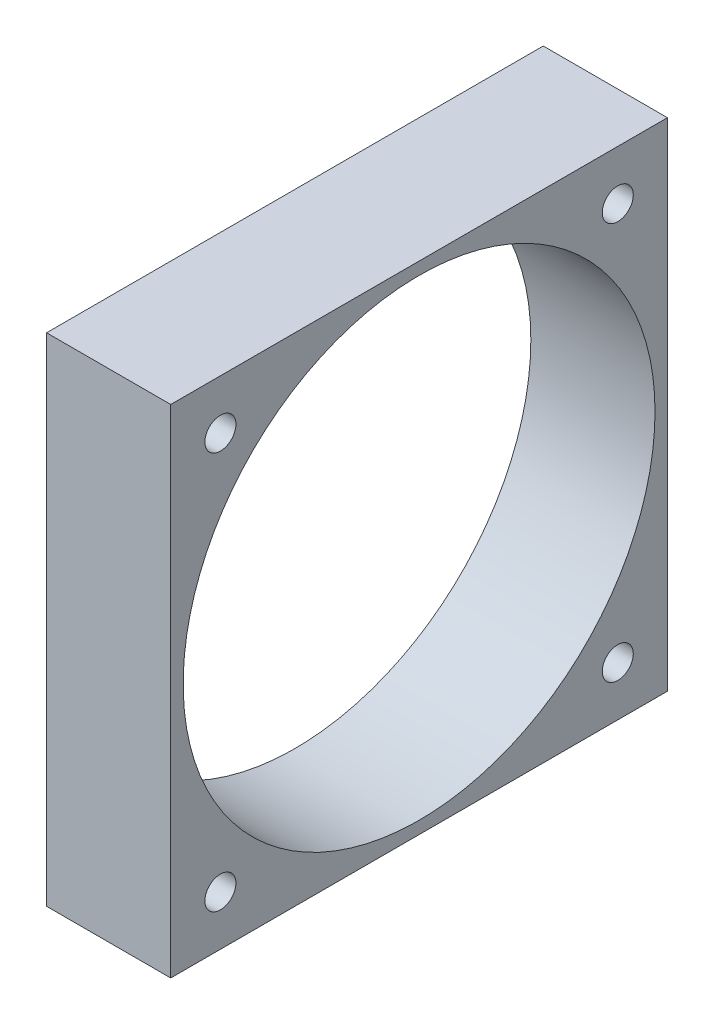
ISO-10303-21;
HEADER;
FILE_DESCRIPTION(('STEP AP214'),'2;1');
FILE_NAME('part.step','',(''),(''),'','','');
FILE_SCHEMA(('AUTOMOTIVE_DESIGN { 1 0 10303 214 1 1 1 1 }'));
ENDSEC;
DATA;
#1=APPLICATION_CONTEXT('core data for automotive mechanical design processes');
#2=APPLICATION_PROTOCOL_DEFINITION('international standard','automotive_design',2000,#1);
#3=PRODUCT_CONTEXT('',#1,'mechanical');
#4=PRODUCT('Part','Part','',(#3));
#5=PRODUCT_RELATED_PRODUCT_CATEGORY('part','',(#4));
#6=PRODUCT_DEFINITION_FORMATION('','',#4);
#7=PRODUCT_DEFINITION_CONTEXT('part definition',#1,'design');
#8=PRODUCT_DEFINITION('design','',#6,#7);
#9=PRODUCT_DEFINITION_SHAPE('','',#8);
#10=(LENGTH_UNIT() NAMED_UNIT(*) SI_UNIT(.MILLI.,.METRE.));
#11=(NAMED_UNIT(*) PLANE_ANGLE_UNIT() SI_UNIT($,.RADIAN.));
#12=(NAMED_UNIT(*) SI_UNIT($,.STERADIAN.) SOLID_ANGLE_UNIT());
#13=UNCERTAINTY_MEASURE_WITH_UNIT(LENGTH_MEASURE(1.E-05),#10,'distance_accuracy_value','');
#14=(GEOMETRIC_REPRESENTATION_CONTEXT(3) GLOBAL_UNCERTAINTY_ASSIGNED_CONTEXT((#13)) GLOBAL_UNIT_ASSIGNED_CONTEXT((#10,
#11,#12)) REPRESENTATION_CONTEXT('',''));
#15=CARTESIAN_POINT('',(0.,0.,0.));
#16=DIRECTION('',(0.,0.,1.));
#17=DIRECTION('',(1.,0.,0.));
#18=AXIS2_PLACEMENT_3D('',#15,#16,#17);
#19=CARTESIAN_POINT('',(10.,0.,0.));
#20=DIRECTION('',(1.,0.,0.));
#21=DIRECTION('',(0.,0.,-1.));
#22=AXIS2_PLACEMENT_3D('',#19,#20,#21);
#23=PLANE('',#22);
#24=CARTESIAN_POINT('',(10.,-16.0000000000001,-16.));
#25=DIRECTION('',(1.,0.,0.));
#26=DIRECTION('',(0.,0.,-1.));
#27=AXIS2_PLACEMENT_3D('',#24,#25,#26);
#28=CIRCLE('',#27,1.25);
#29=CARTESIAN_POINT('',(10.,-16.0000000000001,-17.25));
#30=VERTEX_POINT('',#29);
#31=EDGE_CURVE('E133',#30,#30,#28,.T.);
#32=ORIENTED_EDGE('',*,*,#31,.F.);
#33=EDGE_LOOP('',(#32));
#34=FACE_BOUND('',#33,.T.);
#35=CARTESIAN_POINT('',(10.,16.,16.));
#36=DIRECTION('',(1.,0.,0.));
#37=DIRECTION('',(0.,0.,-1.));
#38=AXIS2_PLACEMENT_3D('',#35,#36,#37);
#39=CIRCLE('',#38,1.25);
#40=CARTESIAN_POINT('',(10.,16.,14.75));
#41=VERTEX_POINT('',#40);
#42=EDGE_CURVE('E121',#41,#41,#39,.T.);
#43=ORIENTED_EDGE('',*,*,#42,.F.);
#44=EDGE_LOOP('',(#43));
#45=FACE_BOUND('',#44,.T.);
#46=DIRECTION('',(0.,1.,0.));
#47=VECTOR('',#46,1.);
#48=CARTESIAN_POINT('',(10.,20.,-20.));
#49=LINE('',#48,#47);
#50=CARTESIAN_POINT('',(10.,-20.,-20.));
#51=VERTEX_POINT('',#50);
#52=CARTESIAN_POINT('',(10.,20.,-20.));
#53=VERTEX_POINT('',#52);
#54=EDGE_CURVE('E91',#51,#53,#49,.T.);
#55=ORIENTED_EDGE('',*,*,#54,.T.);
#56=DIRECTION('',(0.,0.,1.));
#57=VECTOR('',#56,1.);
#58=CARTESIAN_POINT('',(10.,20.,20.));
#59=LINE('',#58,#57);
#60=CARTESIAN_POINT('',(10.,20.,20.));
#61=VERTEX_POINT('',#60);
#62=EDGE_CURVE('E86',#53,#61,#59,.T.);
#63=ORIENTED_EDGE('',*,*,#62,.T.);
#64=DIRECTION('',(0.,-1.,0.));
#65=VECTOR('',#64,1.);
#66=CARTESIAN_POINT('',(10.,20.,20.));
#67=LINE('',#66,#65);
#68=CARTESIAN_POINT('',(10.,-20.,20.));
#69=VERTEX_POINT('',#68);
#70=EDGE_CURVE('E89',#61,#69,#67,.T.);
#71=ORIENTED_EDGE('',*,*,#70,.T.);
#72=DIRECTION('',(0.,0.,-1.));
#73=VECTOR('',#72,1.);
#74=CARTESIAN_POINT('',(10.,-20.,20.));
#75=LINE('',#74,#73);
#76=EDGE_CURVE('E56',#69,#51,#75,.T.);
#77=ORIENTED_EDGE('',*,*,#76,.T.);
#78=EDGE_LOOP('',(#55,#63,#71,#77));
#79=FACE_BOUND('',#78,.T.);
#80=CARTESIAN_POINT('',(10.,0.,0.));
#81=DIRECTION('',(1.,0.,0.));
#82=DIRECTION('',(0.,0.,-1.));
#83=AXIS2_PLACEMENT_3D('',#80,#81,#82);
#84=CIRCLE('',#83,19.);
#85=CARTESIAN_POINT('',(10.,0.,-19.));
#86=VERTEX_POINT('',#85);
#87=EDGE_CURVE('E106',#86,#86,#84,.T.);
#88=ORIENTED_EDGE('',*,*,#87,.F.);
#89=EDGE_LOOP('',(#88));
#90=FACE_BOUND('',#89,.T.);
#91=CARTESIAN_POINT('',(10.,15.9999999999999,-16.));
#92=DIRECTION('',(1.,0.,0.));
#93=DIRECTION('',(0.,0.,-1.));
#94=AXIS2_PLACEMENT_3D('',#91,#92,#93);
#95=CIRCLE('',#94,1.25);
#96=CARTESIAN_POINT('',(10.,15.9999999999999,-17.25));
#97=VERTEX_POINT('',#96);
#98=EDGE_CURVE('E127',#97,#97,#95,.T.);
#99=ORIENTED_EDGE('',*,*,#98,.F.);
#100=EDGE_LOOP('',(#99));
#101=FACE_BOUND('',#100,.T.);
#102=CARTESIAN_POINT('',(10.,-16.,16.));
#103=DIRECTION('',(1.,0.,0.));
#104=DIRECTION('',(0.,0.,-1.));
#105=AXIS2_PLACEMENT_3D('',#102,#103,#104);
#106=CIRCLE('',#105,1.25);
#107=CARTESIAN_POINT('',(10.,-16.,14.75));
#108=VERTEX_POINT('',#107);
#109=EDGE_CURVE('E139',#108,#108,#106,.T.);
#110=ORIENTED_EDGE('',*,*,#109,.F.);
#111=EDGE_LOOP('',(#110));
#112=FACE_BOUND('',#111,.T.);
#113=ADVANCED_FACE('F39',(#34,#45,#79,#90,#101,#112),#23,.T.);
#114=CARTESIAN_POINT('',(0.,0.,0.));
#115=DIRECTION('',(1.,0.,0.));
#116=DIRECTION('',(0.,0.,-1.));
#117=AXIS2_PLACEMENT_3D('',#114,#115,#116);
#118=PLANE('',#117);
#119=DIRECTION('',(0.,1.,0.));
#120=VECTOR('',#119,1.);
#121=CARTESIAN_POINT('',(0.,20.,-20.));
#122=LINE('',#121,#120);
#123=CARTESIAN_POINT('',(0.,-20.,-20.));
#124=VERTEX_POINT('',#123);
#125=CARTESIAN_POINT('',(0.,20.,-20.));
#126=VERTEX_POINT('',#125);
#127=EDGE_CURVE('E103',#124,#126,#122,.T.);
#128=ORIENTED_EDGE('',*,*,#127,.F.);
#129=DIRECTION('',(0.,0.,-1.));
#130=VECTOR('',#129,1.);
#131=CARTESIAN_POINT('',(0.,-20.,20.));
#132=LINE('',#131,#130);
#133=CARTESIAN_POINT('',(0.,-20.,20.));
#134=VERTEX_POINT('',#133);
#135=EDGE_CURVE('E79',#134,#124,#132,.T.);
#136=ORIENTED_EDGE('',*,*,#135,.F.);
#137=DIRECTION('',(0.,-1.,0.));
#138=VECTOR('',#137,1.);
#139=CARTESIAN_POINT('',(0.,20.,20.));
#140=LINE('',#139,#138);
#141=CARTESIAN_POINT('',(0.,20.,20.));
#142=VERTEX_POINT('',#141);
#143=EDGE_CURVE('E73',#142,#134,#140,.T.);
#144=ORIENTED_EDGE('',*,*,#143,.F.);
#145=DIRECTION('',(0.,0.,1.));
#146=VECTOR('',#145,1.);
#147=CARTESIAN_POINT('',(0.,20.,20.));
#148=LINE('',#147,#146);
#149=EDGE_CURVE('E95',#126,#142,#148,.T.);
#150=ORIENTED_EDGE('',*,*,#149,.F.);
#151=EDGE_LOOP('',(#128,#136,#144,#150));
#152=FACE_BOUND('',#151,.T.);
#153=CARTESIAN_POINT('',(0.,0.,0.));
#154=DIRECTION('',(1.,0.,0.));
#155=DIRECTION('',(0.,0.,-1.));
#156=AXIS2_PLACEMENT_3D('',#153,#154,#155);
#157=CIRCLE('',#156,19.);
#158=CARTESIAN_POINT('',(0.,0.,-19.));
#159=VERTEX_POINT('',#158);
#160=EDGE_CURVE('E118',#159,#159,#157,.T.);
#161=ORIENTED_EDGE('',*,*,#160,.T.);
#162=EDGE_LOOP('',(#161));
#163=FACE_BOUND('',#162,.T.);
#164=CARTESIAN_POINT('',(0.,16.,16.));
#165=DIRECTION('',(1.,0.,0.));
#166=DIRECTION('',(0.,0.,-1.));
#167=AXIS2_PLACEMENT_3D('',#164,#165,#166);
#168=CIRCLE('',#167,1.25);
#169=CARTESIAN_POINT('',(0.,16.,14.75));
#170=VERTEX_POINT('',#169);
#171=EDGE_CURVE('E124',#170,#170,#168,.T.);
#172=ORIENTED_EDGE('',*,*,#171,.T.);
#173=EDGE_LOOP('',(#172));
#174=FACE_BOUND('',#173,.T.);
#175=CARTESIAN_POINT('',(0.,15.9999999999999,-16.));
#176=DIRECTION('',(1.,0.,0.));
#177=DIRECTION('',(0.,0.,-1.));
#178=AXIS2_PLACEMENT_3D('',#175,#176,#177);
#179=CIRCLE('',#178,1.25);
#180=CARTESIAN_POINT('',(0.,15.9999999999999,-17.25));
#181=VERTEX_POINT('',#180);
#182=EDGE_CURVE('E130',#181,#181,#179,.T.);
#183=ORIENTED_EDGE('',*,*,#182,.T.);
#184=EDGE_LOOP('',(#183));
#185=FACE_BOUND('',#184,.T.);
#186=CARTESIAN_POINT('',(0.,-16.0000000000001,-16.));
#187=DIRECTION('',(1.,0.,0.));
#188=DIRECTION('',(0.,0.,-1.));
#189=AXIS2_PLACEMENT_3D('',#186,#187,#188);
#190=CIRCLE('',#189,1.25);
#191=CARTESIAN_POINT('',(0.,-16.0000000000001,-17.25));
#192=VERTEX_POINT('',#191);
#193=EDGE_CURVE('E136',#192,#192,#190,.T.);
#194=ORIENTED_EDGE('',*,*,#193,.T.);
#195=EDGE_LOOP('',(#194));
#196=FACE_BOUND('',#195,.T.);
#197=CARTESIAN_POINT('',(0.,-16.,16.));
#198=DIRECTION('',(1.,0.,0.));
#199=DIRECTION('',(0.,0.,-1.));
#200=AXIS2_PLACEMENT_3D('',#197,#198,#199);
#201=CIRCLE('',#200,1.25);
#202=CARTESIAN_POINT('',(0.,-16.,14.75));
#203=VERTEX_POINT('',#202);
#204=EDGE_CURVE('E142',#203,#203,#201,.T.);
#205=ORIENTED_EDGE('',*,*,#204,.T.);
#206=EDGE_LOOP('',(#205));
#207=FACE_BOUND('',#206,.T.);
#208=ADVANCED_FACE('F114',(#152,#163,#174,#185,#196,#207),#118,.F.);
#209=CARTESIAN_POINT('',(10.,20.,-20.));
#210=DIRECTION('',(0.,0.,1.));
#211=DIRECTION('',(0.,-1.,0.));
#212=AXIS2_PLACEMENT_3D('',#209,#210,#211);
#213=PLANE('',#212);
#214=ORIENTED_EDGE('',*,*,#127,.T.);
#215=DIRECTION('',(-1.,0.,0.));
#216=VECTOR('',#215,1.);
#217=CARTESIAN_POINT('',(10.,20.,-20.));
#218=LINE('',#217,#216);
#219=EDGE_CURVE('E11',#53,#126,#218,.T.);
#220=ORIENTED_EDGE('',*,*,#219,.F.);
#221=ORIENTED_EDGE('',*,*,#54,.F.);
#222=DIRECTION('',(-1.,0.,0.));
#223=VECTOR('',#222,1.);
#224=CARTESIAN_POINT('',(10.,-20.,-20.));
#225=LINE('',#224,#223);
#226=EDGE_CURVE('E99',#51,#124,#225,.T.);
#227=ORIENTED_EDGE('',*,*,#226,.T.);
#228=EDGE_LOOP('',(#214,#220,#221,#227));
#229=FACE_BOUND('',#228,.T.);
#230=ADVANCED_FACE('F41',(#229),#213,.F.);
#231=CARTESIAN_POINT('',(10.,20.,20.));
#232=DIRECTION('',(0.,-1.,0.));
#233=DIRECTION('',(0.,0.,-1.));
#234=AXIS2_PLACEMENT_3D('',#231,#232,#233);
#235=PLANE('',#234);
#236=ORIENTED_EDGE('',*,*,#149,.T.);
#237=DIRECTION('',(-1.,0.,0.));
#238=VECTOR('',#237,1.);
#239=CARTESIAN_POINT('',(10.,20.,20.));
#240=LINE('',#239,#238);
#241=EDGE_CURVE('E48',#61,#142,#240,.T.);
#242=ORIENTED_EDGE('',*,*,#241,.F.);
#243=ORIENTED_EDGE('',*,*,#62,.F.);
#244=ORIENTED_EDGE('',*,*,#219,.T.);
#245=EDGE_LOOP('',(#236,#242,#243,#244));
#246=FACE_BOUND('',#245,.T.);
#247=ADVANCED_FACE('F94',(#246),#235,.F.);
#248=CARTESIAN_POINT('',(10.,20.,20.));
#249=DIRECTION('',(0.,0.,-1.));
#250=DIRECTION('',(0.,1.,0.));
#251=AXIS2_PLACEMENT_3D('',#248,#249,#250);
#252=PLANE('',#251);
#253=ORIENTED_EDGE('',*,*,#143,.T.);
#254=DIRECTION('',(-1.,0.,0.));
#255=VECTOR('',#254,1.);
#256=CARTESIAN_POINT('',(10.,-20.,20.));
#257=LINE('',#256,#255);
#258=EDGE_CURVE('E96',#69,#134,#257,.T.);
#259=ORIENTED_EDGE('',*,*,#258,.F.);
#260=ORIENTED_EDGE('',*,*,#70,.F.);
#261=ORIENTED_EDGE('',*,*,#241,.T.);
#262=EDGE_LOOP('',(#253,#259,#260,#261));
#263=FACE_BOUND('',#262,.T.);
#264=ADVANCED_FACE('F97',(#263),#252,.F.);
#265=CARTESIAN_POINT('',(10.,-20.,20.));
#266=DIRECTION('',(0.,1.,0.));
#267=DIRECTION('',(0.,0.,1.));
#268=AXIS2_PLACEMENT_3D('',#265,#266,#267);
#269=PLANE('',#268);
#270=ORIENTED_EDGE('',*,*,#135,.T.);
#271=ORIENTED_EDGE('',*,*,#226,.F.);
#272=ORIENTED_EDGE('',*,*,#76,.F.);
#273=ORIENTED_EDGE('',*,*,#258,.T.);
#274=EDGE_LOOP('',(#270,#271,#272,#273));
#275=FACE_BOUND('',#274,.T.);
#276=ADVANCED_FACE('F111',(#275),#269,.F.);
#277=CARTESIAN_POINT('',(10.,0.,0.));
#278=DIRECTION('',(-1.,0.,0.));
#279=DIRECTION('',(0.,0.,1.));
#280=AXIS2_PLACEMENT_3D('',#277,#278,#279);
#281=CYLINDRICAL_SURFACE('',#280,19.);
#282=ORIENTED_EDGE('',*,*,#87,.T.);
#283=EDGE_LOOP('',(#282));
#284=FACE_BOUND('',#283,.T.);
#285=ORIENTED_EDGE('',*,*,#160,.F.);
#286=EDGE_LOOP('',(#285));
#287=FACE_BOUND('',#286,.T.);
#288=ADVANCED_FACE('F161',(#284,#287),#281,.F.);
#289=CARTESIAN_POINT('',(10.,16.,16.));
#290=DIRECTION('',(-1.,0.,0.));
#291=DIRECTION('',(0.,0.,1.));
#292=AXIS2_PLACEMENT_3D('',#289,#290,#291);
#293=CYLINDRICAL_SURFACE('',#292,1.25);
#294=ORIENTED_EDGE('',*,*,#42,.T.);
#295=EDGE_LOOP('',(#294));
#296=FACE_BOUND('',#295,.T.);
#297=ORIENTED_EDGE('',*,*,#171,.F.);
#298=EDGE_LOOP('',(#297));
#299=FACE_BOUND('',#298,.T.);
#300=ADVANCED_FACE('F206',(#296,#299),#293,.F.);
#301=CARTESIAN_POINT('',(10.,15.9999999999999,-16.));
#302=DIRECTION('',(-1.,0.,0.));
#303=DIRECTION('',(0.,0.,1.));
#304=AXIS2_PLACEMENT_3D('',#301,#302,#303);
#305=CYLINDRICAL_SURFACE('',#304,1.25);
#306=ORIENTED_EDGE('',*,*,#98,.T.);
#307=EDGE_LOOP('',(#306));
#308=FACE_BOUND('',#307,.T.);
#309=ORIENTED_EDGE('',*,*,#182,.F.);
#310=EDGE_LOOP('',(#309));
#311=FACE_BOUND('',#310,.T.);
#312=ADVANCED_FACE('F214',(#308,#311),#305,.F.);
#313=CARTESIAN_POINT('',(10.,-16.0000000000001,-16.));
#314=DIRECTION('',(-1.,0.,0.));
#315=DIRECTION('',(0.,0.,1.));
#316=AXIS2_PLACEMENT_3D('',#313,#314,#315);
#317=CYLINDRICAL_SURFACE('',#316,1.25);
#318=ORIENTED_EDGE('',*,*,#31,.T.);
#319=EDGE_LOOP('',(#318));
#320=FACE_BOUND('',#319,.T.);
#321=ORIENTED_EDGE('',*,*,#193,.F.);
#322=EDGE_LOOP('',(#321));
#323=FACE_BOUND('',#322,.T.);
#324=ADVANCED_FACE('F222',(#320,#323),#317,.F.);
#325=CARTESIAN_POINT('',(10.,-16.,16.));
#326=DIRECTION('',(-1.,0.,0.));
#327=DIRECTION('',(0.,0.,1.));
#328=AXIS2_PLACEMENT_3D('',#325,#326,#327);
#329=CYLINDRICAL_SURFACE('',#328,1.25);
#330=ORIENTED_EDGE('',*,*,#109,.T.);
#331=EDGE_LOOP('',(#330));
#332=FACE_BOUND('',#331,.T.);
#333=ORIENTED_EDGE('',*,*,#204,.F.);
#334=EDGE_LOOP('',(#333));
#335=FACE_BOUND('',#334,.T.);
#336=ADVANCED_FACE('F148',(#332,#335),#329,.F.);
#337=CLOSED_SHELL('',(#113,#208,#230,#247,#264,#276,#288,#300,#312,#324,#336));
#338=MANIFOLD_SOLID_BREP('B2',#337);
#339=ADVANCED_BREP_SHAPE_REPRESENTATION('',(#18,#338),#14);
#340=SHAPE_DEFINITION_REPRESENTATION(#9,#339);
ENDSEC;
END-ISO-10303-21;
